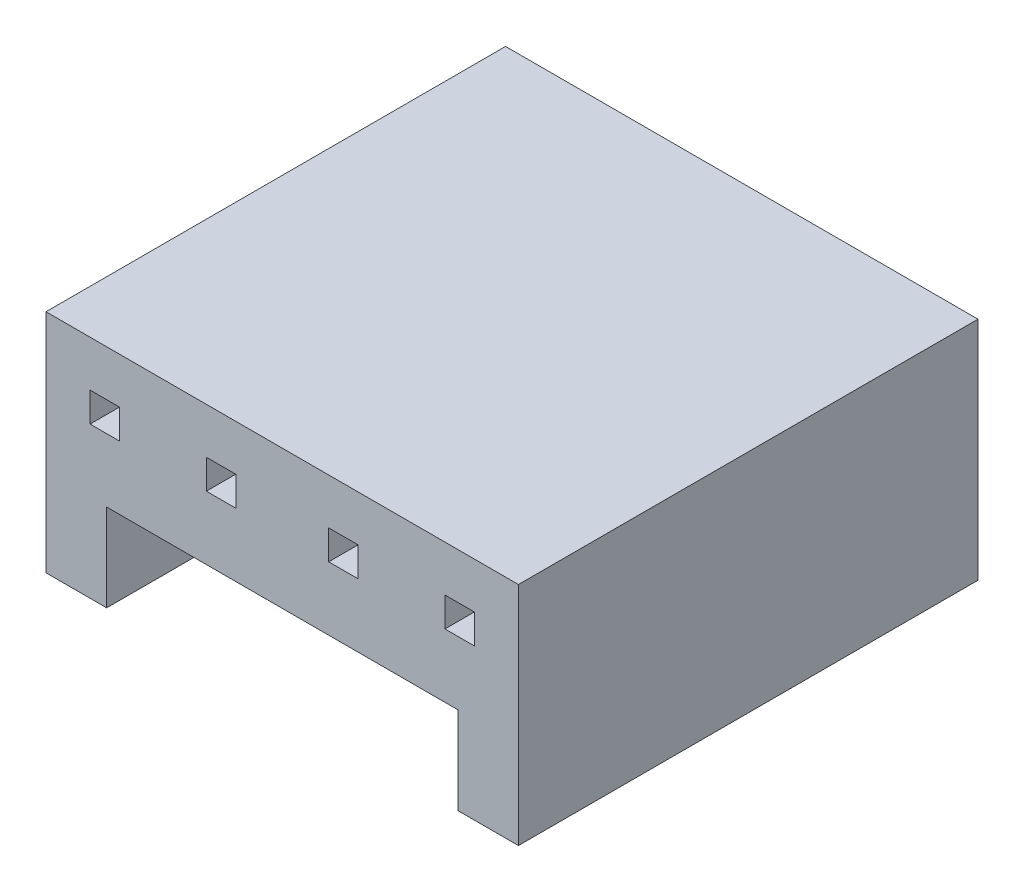
ISO-10303-21;
HEADER;
FILE_DESCRIPTION(('STEP AP214'),'2;1');
FILE_NAME('part.step','',(''),(''),'','','');
FILE_SCHEMA(('AUTOMOTIVE_DESIGN { 1 0 10303 214 1 1 1 1 }'));
ENDSEC;
DATA;
#1=APPLICATION_CONTEXT('core data for automotive mechanical design processes');
#2=APPLICATION_PROTOCOL_DEFINITION('international standard','automotive_design',2000,#1);
#3=PRODUCT_CONTEXT('',#1,'mechanical');
#4=PRODUCT('Part','Part','',(#3));
#5=PRODUCT_RELATED_PRODUCT_CATEGORY('part','',(#4));
#6=PRODUCT_DEFINITION_FORMATION('','',#4);
#7=PRODUCT_DEFINITION_CONTEXT('part definition',#1,'design');
#8=PRODUCT_DEFINITION('design','',#6,#7);
#9=PRODUCT_DEFINITION_SHAPE('','',#8);
#10=(LENGTH_UNIT() NAMED_UNIT(*) SI_UNIT(.MILLI.,.METRE.));
#11=(NAMED_UNIT(*) PLANE_ANGLE_UNIT() SI_UNIT($,.RADIAN.));
#12=(NAMED_UNIT(*) SI_UNIT($,.STERADIAN.) SOLID_ANGLE_UNIT());
#13=UNCERTAINTY_MEASURE_WITH_UNIT(LENGTH_MEASURE(1.E-05),#10,'distance_accuracy_value','');
#14=(GEOMETRIC_REPRESENTATION_CONTEXT(3) GLOBAL_UNCERTAINTY_ASSIGNED_CONTEXT((#13)) GLOBAL_UNIT_ASSIGNED_CONTEXT((#10,
#11,#12)) REPRESENTATION_CONTEXT('',''));
#15=CARTESIAN_POINT('',(0.,0.,0.));
#16=DIRECTION('',(0.,0.,1.));
#17=DIRECTION('',(1.,0.,0.));
#18=AXIS2_PLACEMENT_3D('',#15,#16,#17);
#19=CARTESIAN_POINT('',(0.,0.,-10.));
#20=DIRECTION('',(0.,-1.,0.));
#21=DIRECTION('',(0.,0.,-1.));
#22=AXIS2_PLACEMENT_3D('',#19,#20,#21);
#23=PLANE('',#22);
#24=DIRECTION('',(1.,0.,0.));
#25=VECTOR('',#24,1.);
#26=CARTESIAN_POINT('',(0.,0.,0.));
#27=LINE('',#26,#25);
#28=CARTESIAN_POINT('',(0.,0.,0.));
#29=VERTEX_POINT('',#28);
#30=CARTESIAN_POINT('',(1.32,0.,0.));
#31=VERTEX_POINT('',#30);
#32=EDGE_CURVE('E372',#29,#31,#27,.T.);
#33=ORIENTED_EDGE('',*,*,#32,.F.);
#34=DIRECTION('',(0.,0.,1.));
#35=VECTOR('',#34,1.);
#36=CARTESIAN_POINT('',(0.,0.,-10.));
#37=LINE('',#36,#35);
#38=CARTESIAN_POINT('',(0.,0.,-10.));
#39=VERTEX_POINT('',#38);
#40=EDGE_CURVE('E11',#39,#29,#37,.T.);
#41=ORIENTED_EDGE('',*,*,#40,.F.);
#42=DIRECTION('',(1.,0.,0.));
#43=VECTOR('',#42,1.);
#44=CARTESIAN_POINT('',(0.,0.,-10.));
#45=LINE('',#44,#43);
#46=CARTESIAN_POINT('',(1.32,0.,-10.));
#47=VERTEX_POINT('',#46);
#48=EDGE_CURVE('E382',#39,#47,#45,.T.);
#49=ORIENTED_EDGE('',*,*,#48,.T.);
#50=DIRECTION('',(0.,0.,1.));
#51=VECTOR('',#50,1.);
#52=CARTESIAN_POINT('',(1.32,0.,-10.));
#53=LINE('',#52,#51);
#54=EDGE_CURVE('E42',#47,#31,#53,.T.);
#55=ORIENTED_EDGE('',*,*,#54,.T.);
#56=EDGE_LOOP('',(#33,#41,#49,#55));
#57=FACE_BOUND('',#56,.T.);
#58=ADVANCED_FACE('F39',(#57),#23,.T.);
#59=CARTESIAN_POINT('',(0.,0.,-10.));
#60=DIRECTION('',(-1.,0.,0.));
#61=DIRECTION('',(0.,0.,1.));
#62=AXIS2_PLACEMENT_3D('',#59,#60,#61);
#63=PLANE('',#62);
#64=DIRECTION('',(0.,-1.,0.));
#65=VECTOR('',#64,1.);
#66=CARTESIAN_POINT('',(0.,0.,0.));
#67=LINE('',#66,#65);
#68=CARTESIAN_POINT('',(0.,4.92,0.));
#69=VERTEX_POINT('',#68);
#70=EDGE_CURVE('E387',#69,#29,#67,.T.);
#71=ORIENTED_EDGE('',*,*,#70,.F.);
#72=DIRECTION('',(0.,0.,1.));
#73=VECTOR('',#72,1.);
#74=CARTESIAN_POINT('',(0.,4.92,-10.));
#75=LINE('',#74,#73);
#76=CARTESIAN_POINT('',(0.,4.92,-10.));
#77=VERTEX_POINT('',#76);
#78=EDGE_CURVE('E48',#77,#69,#75,.T.);
#79=ORIENTED_EDGE('',*,*,#78,.F.);
#80=DIRECTION('',(0.,-1.,0.));
#81=VECTOR('',#80,1.);
#82=CARTESIAN_POINT('',(0.,0.,-10.));
#83=LINE('',#82,#81);
#84=EDGE_CURVE('E411',#77,#39,#83,.T.);
#85=ORIENTED_EDGE('',*,*,#84,.T.);
#86=ORIENTED_EDGE('',*,*,#40,.T.);
#87=EDGE_LOOP('',(#71,#79,#85,#86));
#88=FACE_BOUND('',#87,.T.);
#89=ADVANCED_FACE('F474',(#88),#63,.T.);
#90=CARTESIAN_POINT('',(0.,4.92,-10.));
#91=DIRECTION('',(0.,1.,0.));
#92=DIRECTION('',(0.,0.,1.));
#93=AXIS2_PLACEMENT_3D('',#90,#91,#92);
#94=PLANE('',#93);
#95=DIRECTION('',(-1.,0.,0.));
#96=VECTOR('',#95,1.);
#97=CARTESIAN_POINT('',(0.,4.92,0.));
#98=LINE('',#97,#96);
#99=CARTESIAN_POINT('',(10.28,4.92,0.));
#100=VERTEX_POINT('',#99);
#101=EDGE_CURVE('E438',#100,#69,#98,.T.);
#102=ORIENTED_EDGE('',*,*,#101,.F.);
#103=DIRECTION('',(0.,0.,1.));
#104=VECTOR('',#103,1.);
#105=CARTESIAN_POINT('',(10.28,4.92,-10.));
#106=LINE('',#105,#104);
#107=CARTESIAN_POINT('',(10.28,4.92,-10.));
#108=VERTEX_POINT('',#107);
#109=EDGE_CURVE('E447',#108,#100,#106,.T.);
#110=ORIENTED_EDGE('',*,*,#109,.F.);
#111=DIRECTION('',(-1.,0.,0.));
#112=VECTOR('',#111,1.);
#113=CARTESIAN_POINT('',(0.,4.92,-10.));
#114=LINE('',#113,#112);
#115=EDGE_CURVE('E407',#108,#77,#114,.T.);
#116=ORIENTED_EDGE('',*,*,#115,.T.);
#117=ORIENTED_EDGE('',*,*,#78,.T.);
#118=EDGE_LOOP('',(#102,#110,#116,#117));
#119=FACE_BOUND('',#118,.T.);
#120=ADVANCED_FACE('F494',(#119),#94,.T.);
#121=CARTESIAN_POINT('',(10.28,0.,-10.));
#122=DIRECTION('',(1.,0.,0.));
#123=DIRECTION('',(0.,0.,-1.));
#124=AXIS2_PLACEMENT_3D('',#121,#122,#123);
#125=PLANE('',#124);
#126=DIRECTION('',(0.,1.,0.));
#127=VECTOR('',#126,1.);
#128=CARTESIAN_POINT('',(10.28,0.,0.));
#129=LINE('',#128,#127);
#130=CARTESIAN_POINT('',(10.28,0.,0.));
#131=VERTEX_POINT('',#130);
#132=EDGE_CURVE('E434',#131,#100,#129,.T.);
#133=ORIENTED_EDGE('',*,*,#132,.F.);
#134=DIRECTION('',(0.,0.,1.));
#135=VECTOR('',#134,1.);
#136=CARTESIAN_POINT('',(10.28,0.,-10.));
#137=LINE('',#136,#135);
#138=CARTESIAN_POINT('',(10.28,0.,-10.));
#139=VERTEX_POINT('',#138);
#140=EDGE_CURVE('E450',#139,#131,#137,.T.);
#141=ORIENTED_EDGE('',*,*,#140,.F.);
#142=DIRECTION('',(0.,1.,0.));
#143=VECTOR('',#142,1.);
#144=CARTESIAN_POINT('',(10.28,0.,-10.));
#145=LINE('',#144,#143);
#146=EDGE_CURVE('E403',#139,#108,#145,.T.);
#147=ORIENTED_EDGE('',*,*,#146,.T.);
#148=ORIENTED_EDGE('',*,*,#109,.T.);
#149=EDGE_LOOP('',(#133,#141,#147,#148));
#150=FACE_BOUND('',#149,.T.);
#151=ADVANCED_FACE('F492',(#150),#125,.T.);
#152=CARTESIAN_POINT('',(10.28,0.,-10.));
#153=DIRECTION('',(0.,-1.,0.));
#154=DIRECTION('',(0.,0.,-1.));
#155=AXIS2_PLACEMENT_3D('',#152,#153,#154);
#156=PLANE('',#155);
#157=DIRECTION('',(1.,0.,0.));
#158=VECTOR('',#157,1.);
#159=CARTESIAN_POINT('',(10.28,0.,0.));
#160=LINE('',#159,#158);
#161=CARTESIAN_POINT('',(8.96,0.,0.));
#162=VERTEX_POINT('',#161);
#163=EDGE_CURVE('E430',#162,#131,#160,.T.);
#164=ORIENTED_EDGE('',*,*,#163,.F.);
#165=DIRECTION('',(0.,0.,1.));
#166=VECTOR('',#165,1.);
#167=CARTESIAN_POINT('',(8.96,0.,-10.));
#168=LINE('',#167,#166);
#169=CARTESIAN_POINT('',(8.96,0.,-10.));
#170=VERTEX_POINT('',#169);
#171=EDGE_CURVE('E453',#170,#162,#168,.T.);
#172=ORIENTED_EDGE('',*,*,#171,.F.);
#173=DIRECTION('',(1.,0.,0.));
#174=VECTOR('',#173,1.);
#175=CARTESIAN_POINT('',(10.28,0.,-10.));
#176=LINE('',#175,#174);
#177=EDGE_CURVE('E399',#170,#139,#176,.T.);
#178=ORIENTED_EDGE('',*,*,#177,.T.);
#179=ORIENTED_EDGE('',*,*,#140,.T.);
#180=EDGE_LOOP('',(#164,#172,#178,#179));
#181=FACE_BOUND('',#180,.T.);
#182=ADVANCED_FACE('F488',(#181),#156,.T.);
#183=CARTESIAN_POINT('',(8.96,0.,-10.));
#184=DIRECTION('',(-1.,0.,0.));
#185=DIRECTION('',(0.,0.,1.));
#186=AXIS2_PLACEMENT_3D('',#183,#184,#185);
#187=PLANE('',#186);
#188=DIRECTION('',(0.,-1.,0.));
#189=VECTOR('',#188,1.);
#190=CARTESIAN_POINT('',(8.96,0.,0.));
#191=LINE('',#190,#189);
#192=CARTESIAN_POINT('',(8.96,1.9,0.));
#193=VERTEX_POINT('',#192);
#194=EDGE_CURVE('E426',#193,#162,#191,.T.);
#195=ORIENTED_EDGE('',*,*,#194,.F.);
#196=DIRECTION('',(0.,0.,1.));
#197=VECTOR('',#196,1.);
#198=CARTESIAN_POINT('',(8.96,1.9,-10.));
#199=LINE('',#198,#197);
#200=CARTESIAN_POINT('',(8.96,1.9,-10.));
#201=VERTEX_POINT('',#200);
#202=EDGE_CURVE('E456',#201,#193,#199,.T.);
#203=ORIENTED_EDGE('',*,*,#202,.F.);
#204=DIRECTION('',(0.,-1.,0.));
#205=VECTOR('',#204,1.);
#206=CARTESIAN_POINT('',(8.96,0.,-10.));
#207=LINE('',#206,#205);
#208=EDGE_CURVE('E395',#201,#170,#207,.T.);
#209=ORIENTED_EDGE('',*,*,#208,.T.);
#210=ORIENTED_EDGE('',*,*,#171,.T.);
#211=EDGE_LOOP('',(#195,#203,#209,#210));
#212=FACE_BOUND('',#211,.T.);
#213=ADVANCED_FACE('F486',(#212),#187,.T.);
#214=CARTESIAN_POINT('',(1.32,1.9,-10.));
#215=DIRECTION('',(0.,-1.,0.));
#216=DIRECTION('',(1.,0.,0.));
#217=AXIS2_PLACEMENT_3D('',#214,#215,#216);
#218=PLANE('',#217);
#219=DIRECTION('',(1.,0.,0.));
#220=VECTOR('',#219,1.);
#221=CARTESIAN_POINT('',(1.32,1.9,0.));
#222=LINE('',#221,#220);
#223=CARTESIAN_POINT('',(1.32,1.9,0.));
#224=VERTEX_POINT('',#223);
#225=EDGE_CURVE('E422',#224,#193,#222,.T.);
#226=ORIENTED_EDGE('',*,*,#225,.F.);
#227=DIRECTION('',(0.,0.,1.));
#228=VECTOR('',#227,1.);
#229=CARTESIAN_POINT('',(1.32,1.9,-10.));
#230=LINE('',#229,#228);
#231=CARTESIAN_POINT('',(1.32,1.9,-10.));
#232=VERTEX_POINT('',#231);
#233=EDGE_CURVE('E458',#232,#224,#230,.T.);
#234=ORIENTED_EDGE('',*,*,#233,.F.);
#235=DIRECTION('',(1.,0.,0.));
#236=VECTOR('',#235,1.);
#237=CARTESIAN_POINT('',(1.32,1.9,-10.));
#238=LINE('',#237,#236);
#239=EDGE_CURVE('E391',#232,#201,#238,.T.);
#240=ORIENTED_EDGE('',*,*,#239,.T.);
#241=ORIENTED_EDGE('',*,*,#202,.T.);
#242=EDGE_LOOP('',(#226,#234,#240,#241));
#243=FACE_BOUND('',#242,.T.);
#244=ADVANCED_FACE('F482',(#243),#218,.T.);
#245=CARTESIAN_POINT('',(1.32,0.,-10.));
#246=DIRECTION('',(1.,0.,0.));
#247=DIRECTION('',(0.,0.,-1.));
#248=AXIS2_PLACEMENT_3D('',#245,#246,#247);
#249=PLANE('',#248);
#250=DIRECTION('',(0.,1.,0.));
#251=VECTOR('',#250,1.);
#252=CARTESIAN_POINT('',(1.32,0.,0.));
#253=LINE('',#252,#251);
#254=EDGE_CURVE('E418',#31,#224,#253,.T.);
#255=ORIENTED_EDGE('',*,*,#254,.F.);
#256=ORIENTED_EDGE('',*,*,#54,.F.);
#257=DIRECTION('',(0.,1.,0.));
#258=VECTOR('',#257,1.);
#259=CARTESIAN_POINT('',(1.32,0.,-10.));
#260=LINE('',#259,#258);
#261=EDGE_CURVE('E386',#47,#232,#260,.T.);
#262=ORIENTED_EDGE('',*,*,#261,.T.);
#263=ORIENTED_EDGE('',*,*,#233,.T.);
#264=EDGE_LOOP('',(#255,#256,#262,#263));
#265=FACE_BOUND('',#264,.T.);
#266=ADVANCED_FACE('F468',(#265),#249,.T.);
#267=CARTESIAN_POINT('',(0.,0.,-10.));
#268=DIRECTION('',(0.,0.,1.));
#269=DIRECTION('',(1.,0.,0.));
#270=AXIS2_PLACEMENT_3D('',#267,#268,#269);
#271=PLANE('',#270);
#272=DIRECTION('',(0.,1.,0.));
#273=VECTOR('',#272,1.);
#274=CARTESIAN_POINT('',(4.12895977749503,3.28280215856314,-10.));
#275=LINE('',#274,#273);
#276=CARTESIAN_POINT('',(4.12895977749503,3.28280215856314,-10.));
#277=VERTEX_POINT('',#276);
#278=CARTESIAN_POINT('',(4.12895977749503,3.92280215856314,-10.));
#279=VERTEX_POINT('',#278);
#280=EDGE_CURVE('E210',#277,#279,#275,.T.);
#281=ORIENTED_EDGE('',*,*,#280,.T.);
#282=DIRECTION('',(-1.,0.,0.));
#283=VECTOR('',#282,1.);
#284=CARTESIAN_POINT('',(4.12895977749503,3.92280215856314,-10.));
#285=LINE('',#284,#283);
#286=CARTESIAN_POINT('',(3.48895977749503,3.92280215856314,-10.));
#287=VERTEX_POINT('',#286);
#288=EDGE_CURVE('E203',#279,#287,#285,.T.);
#289=ORIENTED_EDGE('',*,*,#288,.T.);
#290=DIRECTION('',(0.,-1.,0.));
#291=VECTOR('',#290,1.);
#292=CARTESIAN_POINT('',(3.48895977749503,3.92280215856314,-10.));
#293=LINE('',#292,#291);
#294=CARTESIAN_POINT('',(3.48895977749503,3.28280215856314,-10.));
#295=VERTEX_POINT('',#294);
#296=EDGE_CURVE('E213',#287,#295,#293,.T.);
#297=ORIENTED_EDGE('',*,*,#296,.T.);
#298=DIRECTION('',(1.,0.,0.));
#299=VECTOR('',#298,1.);
#300=CARTESIAN_POINT('',(3.48895977749503,3.28280215856314,-10.));
#301=LINE('',#300,#299);
#302=EDGE_CURVE('E56',#295,#277,#301,.T.);
#303=ORIENTED_EDGE('',*,*,#302,.T.);
#304=EDGE_LOOP('',(#281,#289,#297,#303));
#305=FACE_BOUND('',#304,.T.);
#306=DIRECTION('',(0.,1.,0.));
#307=VECTOR('',#306,1.);
#308=CARTESIAN_POINT('',(9.32104022250497,3.92280215856314,-10.));
#309=LINE('',#308,#307);
#310=CARTESIAN_POINT('',(9.32104022250497,3.28280215856314,-10.));
#311=VERTEX_POINT('',#310);
#312=CARTESIAN_POINT('',(9.32104022250497,3.92280215856314,-10.));
#313=VERTEX_POINT('',#312);
#314=EDGE_CURVE('E263',#311,#313,#309,.T.);
#315=ORIENTED_EDGE('',*,*,#314,.T.);
#316=DIRECTION('',(-1.,0.,0.));
#317=VECTOR('',#316,1.);
#318=CARTESIAN_POINT('',(9.32104022250497,3.92280215856314,-10.));
#319=LINE('',#318,#317);
#320=CARTESIAN_POINT('',(8.68104022250497,3.92280215856314,-10.));
#321=VERTEX_POINT('',#320);
#322=EDGE_CURVE('E250',#313,#321,#319,.T.);
#323=ORIENTED_EDGE('',*,*,#322,.T.);
#324=DIRECTION('',(0.,-1.,0.));
#325=VECTOR('',#324,1.);
#326=CARTESIAN_POINT('',(8.68104022250497,3.92280215856314,-10.));
#327=LINE('',#326,#325);
#328=CARTESIAN_POINT('',(8.68104022250497,3.28280215856314,-10.));
#329=VERTEX_POINT('',#328);
#330=EDGE_CURVE('E254',#321,#329,#327,.T.);
#331=ORIENTED_EDGE('',*,*,#330,.T.);
#332=DIRECTION('',(1.,0.,0.));
#333=VECTOR('',#332,1.);
#334=CARTESIAN_POINT('',(9.32104022250497,3.28280215856314,-10.));
#335=LINE('',#334,#333);
#336=EDGE_CURVE('E259',#329,#311,#335,.T.);
#337=ORIENTED_EDGE('',*,*,#336,.T.);
#338=EDGE_LOOP('',(#315,#323,#331,#337));
#339=FACE_BOUND('',#338,.T.);
#340=DIRECTION('',(0.,1.,0.));
#341=VECTOR('',#340,1.);
#342=CARTESIAN_POINT('',(1.59895977749503,3.92280215856314,-10.));
#343=LINE('',#342,#341);
#344=CARTESIAN_POINT('',(1.59895977749503,3.28280215856314,-10.));
#345=VERTEX_POINT('',#344);
#346=CARTESIAN_POINT('',(1.59895977749503,3.92280215856314,-10.));
#347=VERTEX_POINT('',#346);
#348=EDGE_CURVE('E307',#345,#347,#343,.T.);
#349=ORIENTED_EDGE('',*,*,#348,.T.);
#350=DIRECTION('',(-1.,0.,0.));
#351=VECTOR('',#350,1.);
#352=CARTESIAN_POINT('',(0.958959777495029,3.92280215856314,-10.));
#353=LINE('',#352,#351);
#354=CARTESIAN_POINT('',(0.958959777495029,3.92280215856314,-10.));
#355=VERTEX_POINT('',#354);
#356=EDGE_CURVE('E294',#347,#355,#353,.T.);
#357=ORIENTED_EDGE('',*,*,#356,.T.);
#358=DIRECTION('',(0.,-1.,0.));
#359=VECTOR('',#358,1.);
#360=CARTESIAN_POINT('',(0.958959777495029,3.92280215856314,-10.));
#361=LINE('',#360,#359);
#362=CARTESIAN_POINT('',(0.958959777495029,3.28280215856314,-10.));
#363=VERTEX_POINT('',#362);
#364=EDGE_CURVE('E298',#355,#363,#361,.T.);
#365=ORIENTED_EDGE('',*,*,#364,.T.);
#366=DIRECTION('',(1.,0.,0.));
#367=VECTOR('',#366,1.);
#368=CARTESIAN_POINT('',(0.958959777495029,3.28280215856314,-10.));
#369=LINE('',#368,#367);
#370=EDGE_CURVE('E303',#363,#345,#369,.T.);
#371=ORIENTED_EDGE('',*,*,#370,.T.);
#372=EDGE_LOOP('',(#349,#357,#365,#371));
#373=FACE_BOUND('',#372,.T.);
#374=DIRECTION('',(-1.,0.,0.));
#375=VECTOR('',#374,1.);
#376=CARTESIAN_POINT('',(6.15104022250497,3.92280215856314,-10.));
#377=LINE('',#376,#375);
#378=CARTESIAN_POINT('',(6.79104022250497,3.92280215856314,-10.));
#379=VERTEX_POINT('',#378);
#380=CARTESIAN_POINT('',(6.15104022250497,3.92280215856314,-10.));
#381=VERTEX_POINT('',#380);
#382=EDGE_CURVE('E351',#379,#381,#377,.T.);
#383=ORIENTED_EDGE('',*,*,#382,.T.);
#384=DIRECTION('',(0.,-1.,0.));
#385=VECTOR('',#384,1.);
#386=CARTESIAN_POINT('',(6.15104022250497,3.28280215856314,-10.));
#387=LINE('',#386,#385);
#388=CARTESIAN_POINT('',(6.15104022250497,3.28280215856314,-10.));
#389=VERTEX_POINT('',#388);
#390=EDGE_CURVE('E338',#381,#389,#387,.T.);
#391=ORIENTED_EDGE('',*,*,#390,.T.);
#392=DIRECTION('',(1.,0.,0.));
#393=VECTOR('',#392,1.);
#394=CARTESIAN_POINT('',(6.79104022250497,3.28280215856314,-10.));
#395=LINE('',#394,#393);
#396=CARTESIAN_POINT('',(6.79104022250497,3.28280215856314,-10.));
#397=VERTEX_POINT('',#396);
#398=EDGE_CURVE('E342',#389,#397,#395,.T.);
#399=ORIENTED_EDGE('',*,*,#398,.T.);
#400=DIRECTION('',(0.,1.,0.));
#401=VECTOR('',#400,1.);
#402=CARTESIAN_POINT('',(6.79104022250497,3.92280215856314,-10.));
#403=LINE('',#402,#401);
#404=EDGE_CURVE('E347',#397,#379,#403,.T.);
#405=ORIENTED_EDGE('',*,*,#404,.T.);
#406=EDGE_LOOP('',(#383,#391,#399,#405));
#407=FACE_BOUND('',#406,.T.);
#408=ORIENTED_EDGE('',*,*,#48,.F.);
#409=ORIENTED_EDGE('',*,*,#84,.F.);
#410=ORIENTED_EDGE('',*,*,#115,.F.);
#411=ORIENTED_EDGE('',*,*,#146,.F.);
#412=ORIENTED_EDGE('',*,*,#177,.F.);
#413=ORIENTED_EDGE('',*,*,#208,.F.);
#414=ORIENTED_EDGE('',*,*,#239,.F.);
#415=ORIENTED_EDGE('',*,*,#261,.F.);
#416=EDGE_LOOP('',(#408,#409,#410,#411,#412,#413,#414,#415));
#417=FACE_BOUND('',#416,.T.);
#418=ADVANCED_FACE('F218',(#305,#339,#373,#407,#417),#271,.F.);
#419=CARTESIAN_POINT('',(0.,0.,0.));
#420=DIRECTION('',(0.,0.,1.));
#421=DIRECTION('',(1.,0.,0.));
#422=AXIS2_PLACEMENT_3D('',#419,#420,#421);
#423=PLANE('',#422);
#424=DIRECTION('',(-1.,0.,0.));
#425=VECTOR('',#424,1.);
#426=CARTESIAN_POINT('',(4.12895977749503,3.92280215856314,0.));
#427=LINE('',#426,#425);
#428=CARTESIAN_POINT('',(4.12895977749503,3.92280215856314,0.));
#429=VERTEX_POINT('',#428);
#430=CARTESIAN_POINT('',(3.48895977749503,3.92280215856314,0.));
#431=VERTEX_POINT('',#430);
#432=EDGE_CURVE('E64',#429,#431,#427,.T.);
#433=ORIENTED_EDGE('',*,*,#432,.F.);
#434=DIRECTION('',(0.,1.,0.));
#435=VECTOR('',#434,1.);
#436=CARTESIAN_POINT('',(4.12895977749503,3.28280215856314,0.));
#437=LINE('',#436,#435);
#438=CARTESIAN_POINT('',(4.12895977749503,3.28280215856314,0.));
#439=VERTEX_POINT('',#438);
#440=EDGE_CURVE('E222',#439,#429,#437,.T.);
#441=ORIENTED_EDGE('',*,*,#440,.F.);
#442=DIRECTION('',(1.,0.,0.));
#443=VECTOR('',#442,1.);
#444=CARTESIAN_POINT('',(3.48895977749503,3.28280215856314,0.));
#445=LINE('',#444,#443);
#446=CARTESIAN_POINT('',(3.48895977749503,3.28280215856314,0.));
#447=VERTEX_POINT('',#446);
#448=EDGE_CURVE('E226',#447,#439,#445,.T.);
#449=ORIENTED_EDGE('',*,*,#448,.F.);
#450=DIRECTION('',(0.,-1.,0.));
#451=VECTOR('',#450,1.);
#452=CARTESIAN_POINT('',(3.48895977749503,3.92280215856314,0.));
#453=LINE('',#452,#451);
#454=EDGE_CURVE('E235',#431,#447,#453,.T.);
#455=ORIENTED_EDGE('',*,*,#454,.F.);
#456=EDGE_LOOP('',(#433,#441,#449,#455));
#457=FACE_BOUND('',#456,.T.);
#458=DIRECTION('',(-1.,0.,0.));
#459=VECTOR('',#458,1.);
#460=CARTESIAN_POINT('',(9.32104022250497,3.92280215856314,0.));
#461=LINE('',#460,#459);
#462=CARTESIAN_POINT('',(9.32104022250497,3.92280215856314,0.));
#463=VERTEX_POINT('',#462);
#464=CARTESIAN_POINT('',(8.68104022250497,3.92280215856314,0.));
#465=VERTEX_POINT('',#464);
#466=EDGE_CURVE('E244',#463,#465,#461,.T.);
#467=ORIENTED_EDGE('',*,*,#466,.F.);
#468=DIRECTION('',(0.,1.,0.));
#469=VECTOR('',#468,1.);
#470=CARTESIAN_POINT('',(9.32104022250497,3.92280215856314,0.));
#471=LINE('',#470,#469);
#472=CARTESIAN_POINT('',(9.32104022250497,3.28280215856314,0.));
#473=VERTEX_POINT('',#472);
#474=EDGE_CURVE('E255',#473,#463,#471,.T.);
#475=ORIENTED_EDGE('',*,*,#474,.F.);
#476=DIRECTION('',(1.,0.,0.));
#477=VECTOR('',#476,1.);
#478=CARTESIAN_POINT('',(9.32104022250497,3.28280215856314,0.));
#479=LINE('',#478,#477);
#480=CARTESIAN_POINT('',(8.68104022250497,3.28280215856314,0.));
#481=VERTEX_POINT('',#480);
#482=EDGE_CURVE('E274',#481,#473,#479,.T.);
#483=ORIENTED_EDGE('',*,*,#482,.F.);
#484=DIRECTION('',(0.,-1.,0.));
#485=VECTOR('',#484,1.);
#486=CARTESIAN_POINT('',(8.68104022250497,3.92280215856314,0.));
#487=LINE('',#486,#485);
#488=EDGE_CURVE('E270',#465,#481,#487,.T.);
#489=ORIENTED_EDGE('',*,*,#488,.F.);
#490=EDGE_LOOP('',(#467,#475,#483,#489));
#491=FACE_BOUND('',#490,.T.);
#492=DIRECTION('',(-1.,0.,0.));
#493=VECTOR('',#492,1.);
#494=CARTESIAN_POINT('',(0.958959777495029,3.92280215856314,0.));
#495=LINE('',#494,#493);
#496=CARTESIAN_POINT('',(1.59895977749503,3.92280215856314,0.));
#497=VERTEX_POINT('',#496);
#498=CARTESIAN_POINT('',(0.958959777495029,3.92280215856314,0.));
#499=VERTEX_POINT('',#498);
#500=EDGE_CURVE('E284',#497,#499,#495,.T.);
#501=ORIENTED_EDGE('',*,*,#500,.F.);
#502=DIRECTION('',(0.,1.,0.));
#503=VECTOR('',#502,1.);
#504=CARTESIAN_POINT('',(1.59895977749503,3.92280215856314,0.));
#505=LINE('',#504,#503);
#506=CARTESIAN_POINT('',(1.59895977749503,3.28280215856314,0.));
#507=VERTEX_POINT('',#506);
#508=EDGE_CURVE('E299',#507,#497,#505,.T.);
#509=ORIENTED_EDGE('',*,*,#508,.F.);
#510=DIRECTION('',(1.,0.,0.));
#511=VECTOR('',#510,1.);
#512=CARTESIAN_POINT('',(0.958959777495029,3.28280215856314,0.));
#513=LINE('',#512,#511);
#514=CARTESIAN_POINT('',(0.958959777495029,3.28280215856314,0.));
#515=VERTEX_POINT('',#514);
#516=EDGE_CURVE('E318',#515,#507,#513,.T.);
#517=ORIENTED_EDGE('',*,*,#516,.F.);
#518=DIRECTION('',(0.,-1.,0.));
#519=VECTOR('',#518,1.);
#520=CARTESIAN_POINT('',(0.958959777495029,3.92280215856314,0.));
#521=LINE('',#520,#519);
#522=EDGE_CURVE('E314',#499,#515,#521,.T.);
#523=ORIENTED_EDGE('',*,*,#522,.F.);
#524=EDGE_LOOP('',(#501,#509,#517,#523));
#525=FACE_BOUND('',#524,.T.);
#526=DIRECTION('',(0.,-1.,0.));
#527=VECTOR('',#526,1.);
#528=CARTESIAN_POINT('',(6.15104022250497,3.28280215856314,0.));
#529=LINE('',#528,#527);
#530=CARTESIAN_POINT('',(6.15104022250497,3.92280215856314,0.));
#531=VERTEX_POINT('',#530);
#532=CARTESIAN_POINT('',(6.15104022250497,3.28280215856314,0.));
#533=VERTEX_POINT('',#532);
#534=EDGE_CURVE('E328',#531,#533,#529,.T.);
#535=ORIENTED_EDGE('',*,*,#534,.F.);
#536=DIRECTION('',(-1.,0.,0.));
#537=VECTOR('',#536,1.);
#538=CARTESIAN_POINT('',(6.15104022250497,3.92280215856314,0.));
#539=LINE('',#538,#537);
#540=CARTESIAN_POINT('',(6.79104022250497,3.92280215856314,0.));
#541=VERTEX_POINT('',#540);
#542=EDGE_CURVE('E343',#541,#531,#539,.T.);
#543=ORIENTED_EDGE('',*,*,#542,.F.);
#544=DIRECTION('',(0.,1.,0.));
#545=VECTOR('',#544,1.);
#546=CARTESIAN_POINT('',(6.79104022250497,3.92280215856314,0.));
#547=LINE('',#546,#545);
#548=CARTESIAN_POINT('',(6.79104022250497,3.28280215856314,0.));
#549=VERTEX_POINT('',#548);
#550=EDGE_CURVE('E362',#549,#541,#547,.T.);
#551=ORIENTED_EDGE('',*,*,#550,.F.);
#552=DIRECTION('',(1.,0.,0.));
#553=VECTOR('',#552,1.);
#554=CARTESIAN_POINT('',(6.79104022250497,3.28280215856314,0.));
#555=LINE('',#554,#553);
#556=EDGE_CURVE('E358',#533,#549,#555,.T.);
#557=ORIENTED_EDGE('',*,*,#556,.F.);
#558=EDGE_LOOP('',(#535,#543,#551,#557));
#559=FACE_BOUND('',#558,.T.);
#560=ORIENTED_EDGE('',*,*,#32,.T.);
#561=ORIENTED_EDGE('',*,*,#254,.T.);
#562=ORIENTED_EDGE('',*,*,#225,.T.);
#563=ORIENTED_EDGE('',*,*,#194,.T.);
#564=ORIENTED_EDGE('',*,*,#163,.T.);
#565=ORIENTED_EDGE('',*,*,#132,.T.);
#566=ORIENTED_EDGE('',*,*,#101,.T.);
#567=ORIENTED_EDGE('',*,*,#70,.T.);
#568=EDGE_LOOP('',(#560,#561,#562,#563,#564,#565,#566,#567));
#569=FACE_BOUND('',#568,.T.);
#570=ADVANCED_FACE('F470',(#457,#491,#525,#559,#569),#423,.T.);
#571=CARTESIAN_POINT('',(6.15104022250497,3.28280215856314,-10.));
#572=DIRECTION('',(-1.,0.,0.));
#573=DIRECTION('',(0.,0.,1.));
#574=AXIS2_PLACEMENT_3D('',#571,#572,#573);
#575=PLANE('',#574);
#576=ORIENTED_EDGE('',*,*,#534,.T.);
#577=DIRECTION('',(0.,0.,1.));
#578=VECTOR('',#577,1.);
#579=CARTESIAN_POINT('',(6.15104022250497,3.28280215856314,-10.));
#580=LINE('',#579,#578);
#581=EDGE_CURVE('E355',#389,#533,#580,.T.);
#582=ORIENTED_EDGE('',*,*,#581,.F.);
#583=ORIENTED_EDGE('',*,*,#390,.F.);
#584=DIRECTION('',(0.,0.,1.));
#585=VECTOR('',#584,1.);
#586=CARTESIAN_POINT('',(6.15104022250497,3.92280215856314,-10.));
#587=LINE('',#586,#585);
#588=EDGE_CURVE('E369',#381,#531,#587,.T.);
#589=ORIENTED_EDGE('',*,*,#588,.T.);
#590=EDGE_LOOP('',(#576,#582,#583,#589));
#591=FACE_BOUND('',#590,.T.);
#592=ADVANCED_FACE('F568',(#591),#575,.F.);
#593=CARTESIAN_POINT('',(6.15104022250497,3.92280215856314,-10.));
#594=DIRECTION('',(0.,1.,0.));
#595=DIRECTION('',(0.,0.,1.));
#596=AXIS2_PLACEMENT_3D('',#593,#594,#595);
#597=PLANE('',#596);
#598=ORIENTED_EDGE('',*,*,#542,.T.);
#599=ORIENTED_EDGE('',*,*,#588,.F.);
#600=ORIENTED_EDGE('',*,*,#382,.F.);
#601=DIRECTION('',(0.,0.,1.));
#602=VECTOR('',#601,1.);
#603=CARTESIAN_POINT('',(6.79104022250497,3.92280215856314,-10.));
#604=LINE('',#603,#602);
#605=EDGE_CURVE('E373',#379,#541,#604,.T.);
#606=ORIENTED_EDGE('',*,*,#605,.T.);
#607=EDGE_LOOP('',(#598,#599,#600,#606));
#608=FACE_BOUND('',#607,.T.);
#609=ADVANCED_FACE('F578',(#608),#597,.F.);
#610=CARTESIAN_POINT('',(6.79104022250497,3.92280215856314,-10.));
#611=DIRECTION('',(1.,0.,0.));
#612=DIRECTION('',(0.,0.,-1.));
#613=AXIS2_PLACEMENT_3D('',#610,#611,#612);
#614=PLANE('',#613);
#615=ORIENTED_EDGE('',*,*,#550,.T.);
#616=ORIENTED_EDGE('',*,*,#605,.F.);
#617=ORIENTED_EDGE('',*,*,#404,.F.);
#618=DIRECTION('',(0.,0.,1.));
#619=VECTOR('',#618,1.);
#620=CARTESIAN_POINT('',(6.79104022250497,3.28280215856314,-10.));
#621=LINE('',#620,#619);
#622=EDGE_CURVE('E376',#397,#549,#621,.T.);
#623=ORIENTED_EDGE('',*,*,#622,.T.);
#624=EDGE_LOOP('',(#615,#616,#617,#623));
#625=FACE_BOUND('',#624,.T.);
#626=ADVANCED_FACE('F588',(#625),#614,.F.);
#627=CARTESIAN_POINT('',(6.79104022250497,3.28280215856314,-10.));
#628=DIRECTION('',(0.,-1.,0.));
#629=DIRECTION('',(0.,0.,-1.));
#630=AXIS2_PLACEMENT_3D('',#627,#628,#629);
#631=PLANE('',#630);
#632=ORIENTED_EDGE('',*,*,#556,.T.);
#633=ORIENTED_EDGE('',*,*,#622,.F.);
#634=ORIENTED_EDGE('',*,*,#398,.F.);
#635=ORIENTED_EDGE('',*,*,#581,.T.);
#636=EDGE_LOOP('',(#632,#633,#634,#635));
#637=FACE_BOUND('',#636,.T.);
#638=ADVANCED_FACE('F598',(#637),#631,.F.);
#639=CARTESIAN_POINT('',(0.958959777495029,3.92280215856314,-10.));
#640=DIRECTION('',(0.,1.,0.));
#641=DIRECTION('',(0.,0.,1.));
#642=AXIS2_PLACEMENT_3D('',#639,#640,#641);
#643=PLANE('',#642);
#644=ORIENTED_EDGE('',*,*,#500,.T.);
#645=DIRECTION('',(0.,0.,1.));
#646=VECTOR('',#645,1.);
#647=CARTESIAN_POINT('',(0.958959777495029,3.92280215856314,-10.));
#648=LINE('',#647,#646);
#649=EDGE_CURVE('E311',#355,#499,#648,.T.);
#650=ORIENTED_EDGE('',*,*,#649,.F.);
#651=ORIENTED_EDGE('',*,*,#356,.F.);
#652=DIRECTION('',(0.,0.,1.));
#653=VECTOR('',#652,1.);
#654=CARTESIAN_POINT('',(1.59895977749503,3.92280215856314,-10.));
#655=LINE('',#654,#653);
#656=EDGE_CURVE('E325',#347,#497,#655,.T.);
#657=ORIENTED_EDGE('',*,*,#656,.T.);
#658=EDGE_LOOP('',(#644,#650,#651,#657));
#659=FACE_BOUND('',#658,.T.);
#660=ADVANCED_FACE('F608',(#659),#643,.F.);
#661=CARTESIAN_POINT('',(1.59895977749503,3.92280215856314,-10.));
#662=DIRECTION('',(1.,0.,0.));
#663=DIRECTION('',(0.,0.,-1.));
#664=AXIS2_PLACEMENT_3D('',#661,#662,#663);
#665=PLANE('',#664);
#666=ORIENTED_EDGE('',*,*,#508,.T.);
#667=ORIENTED_EDGE('',*,*,#656,.F.);
#668=ORIENTED_EDGE('',*,*,#348,.F.);
#669=DIRECTION('',(0.,0.,1.));
#670=VECTOR('',#669,1.);
#671=CARTESIAN_POINT('',(1.59895977749503,3.28280215856314,-10.));
#672=LINE('',#671,#670);
#673=EDGE_CURVE('E329',#345,#507,#672,.T.);
#674=ORIENTED_EDGE('',*,*,#673,.T.);
#675=EDGE_LOOP('',(#666,#667,#668,#674));
#676=FACE_BOUND('',#675,.T.);
#677=ADVANCED_FACE('F618',(#676),#665,.F.);
#678=CARTESIAN_POINT('',(0.958959777495029,3.28280215856314,-10.));
#679=DIRECTION('',(0.,-1.,0.));
#680=DIRECTION('',(0.,0.,-1.));
#681=AXIS2_PLACEMENT_3D('',#678,#679,#680);
#682=PLANE('',#681);
#683=ORIENTED_EDGE('',*,*,#516,.T.);
#684=ORIENTED_EDGE('',*,*,#673,.F.);
#685=ORIENTED_EDGE('',*,*,#370,.F.);
#686=DIRECTION('',(0.,0.,1.));
#687=VECTOR('',#686,1.);
#688=CARTESIAN_POINT('',(0.958959777495029,3.28280215856314,-10.));
#689=LINE('',#688,#687);
#690=EDGE_CURVE('E332',#363,#515,#689,.T.);
#691=ORIENTED_EDGE('',*,*,#690,.T.);
#692=EDGE_LOOP('',(#683,#684,#685,#691));
#693=FACE_BOUND('',#692,.T.);
#694=ADVANCED_FACE('F628',(#693),#682,.F.);
#695=CARTESIAN_POINT('',(0.958959777495029,3.92280215856314,-10.));
#696=DIRECTION('',(-1.,0.,0.));
#697=DIRECTION('',(0.,0.,1.));
#698=AXIS2_PLACEMENT_3D('',#695,#696,#697);
#699=PLANE('',#698);
#700=ORIENTED_EDGE('',*,*,#522,.T.);
#701=ORIENTED_EDGE('',*,*,#690,.F.);
#702=ORIENTED_EDGE('',*,*,#364,.F.);
#703=ORIENTED_EDGE('',*,*,#649,.T.);
#704=EDGE_LOOP('',(#700,#701,#702,#703));
#705=FACE_BOUND('',#704,.T.);
#706=ADVANCED_FACE('F638',(#705),#699,.F.);
#707=CARTESIAN_POINT('',(9.32104022250497,3.92280215856314,-10.));
#708=DIRECTION('',(0.,1.,0.));
#709=DIRECTION('',(0.,0.,1.));
#710=AXIS2_PLACEMENT_3D('',#707,#708,#709);
#711=PLANE('',#710);
#712=ORIENTED_EDGE('',*,*,#466,.T.);
#713=DIRECTION('',(0.,0.,1.));
#714=VECTOR('',#713,1.);
#715=CARTESIAN_POINT('',(8.68104022250497,3.92280215856314,-10.));
#716=LINE('',#715,#714);
#717=EDGE_CURVE('E267',#321,#465,#716,.T.);
#718=ORIENTED_EDGE('',*,*,#717,.F.);
#719=ORIENTED_EDGE('',*,*,#322,.F.);
#720=DIRECTION('',(0.,0.,1.));
#721=VECTOR('',#720,1.);
#722=CARTESIAN_POINT('',(9.32104022250497,3.92280215856314,-10.));
#723=LINE('',#722,#721);
#724=EDGE_CURVE('E281',#313,#463,#723,.T.);
#725=ORIENTED_EDGE('',*,*,#724,.T.);
#726=EDGE_LOOP('',(#712,#718,#719,#725));
#727=FACE_BOUND('',#726,.T.);
#728=ADVANCED_FACE('F648',(#727),#711,.F.);
#729=CARTESIAN_POINT('',(9.32104022250497,3.92280215856314,-10.));
#730=DIRECTION('',(1.,0.,0.));
#731=DIRECTION('',(0.,0.,-1.));
#732=AXIS2_PLACEMENT_3D('',#729,#730,#731);
#733=PLANE('',#732);
#734=ORIENTED_EDGE('',*,*,#474,.T.);
#735=ORIENTED_EDGE('',*,*,#724,.F.);
#736=ORIENTED_EDGE('',*,*,#314,.F.);
#737=DIRECTION('',(0.,0.,1.));
#738=VECTOR('',#737,1.);
#739=CARTESIAN_POINT('',(9.32104022250497,3.28280215856314,-10.));
#740=LINE('',#739,#738);
#741=EDGE_CURVE('E285',#311,#473,#740,.T.);
#742=ORIENTED_EDGE('',*,*,#741,.T.);
#743=EDGE_LOOP('',(#734,#735,#736,#742));
#744=FACE_BOUND('',#743,.T.);
#745=ADVANCED_FACE('F658',(#744),#733,.F.);
#746=CARTESIAN_POINT('',(9.32104022250497,3.28280215856314,-10.));
#747=DIRECTION('',(0.,-1.,0.));
#748=DIRECTION('',(0.,0.,-1.));
#749=AXIS2_PLACEMENT_3D('',#746,#747,#748);
#750=PLANE('',#749);
#751=ORIENTED_EDGE('',*,*,#482,.T.);
#752=ORIENTED_EDGE('',*,*,#741,.F.);
#753=ORIENTED_EDGE('',*,*,#336,.F.);
#754=DIRECTION('',(0.,0.,1.));
#755=VECTOR('',#754,1.);
#756=CARTESIAN_POINT('',(8.68104022250497,3.28280215856314,-10.));
#757=LINE('',#756,#755);
#758=EDGE_CURVE('E288',#329,#481,#757,.T.);
#759=ORIENTED_EDGE('',*,*,#758,.T.);
#760=EDGE_LOOP('',(#751,#752,#753,#759));
#761=FACE_BOUND('',#760,.T.);
#762=ADVANCED_FACE('F668',(#761),#750,.F.);
#763=CARTESIAN_POINT('',(8.68104022250497,3.92280215856314,-10.));
#764=DIRECTION('',(-1.,0.,0.));
#765=DIRECTION('',(0.,0.,1.));
#766=AXIS2_PLACEMENT_3D('',#763,#764,#765);
#767=PLANE('',#766);
#768=ORIENTED_EDGE('',*,*,#488,.T.);
#769=ORIENTED_EDGE('',*,*,#758,.F.);
#770=ORIENTED_EDGE('',*,*,#330,.F.);
#771=ORIENTED_EDGE('',*,*,#717,.T.);
#772=EDGE_LOOP('',(#768,#769,#770,#771));
#773=FACE_BOUND('',#772,.T.);
#774=ADVANCED_FACE('F678',(#773),#767,.F.);
#775=CARTESIAN_POINT('',(4.12895977749503,3.92280215856314,-10.));
#776=DIRECTION('',(0.,1.,0.));
#777=DIRECTION('',(0.,0.,1.));
#778=AXIS2_PLACEMENT_3D('',#775,#776,#777);
#779=PLANE('',#778);
#780=ORIENTED_EDGE('',*,*,#432,.T.);
#781=DIRECTION('',(0.,0.,1.));
#782=VECTOR('',#781,1.);
#783=CARTESIAN_POINT('',(3.48895977749503,3.92280215856314,-10.));
#784=LINE('',#783,#782);
#785=EDGE_CURVE('E199',#287,#431,#784,.T.);
#786=ORIENTED_EDGE('',*,*,#785,.F.);
#787=ORIENTED_EDGE('',*,*,#288,.F.);
#788=DIRECTION('',(0.,0.,1.));
#789=VECTOR('',#788,1.);
#790=CARTESIAN_POINT('',(4.12895977749503,3.92280215856314,-10.));
#791=LINE('',#790,#789);
#792=EDGE_CURVE('E241',#279,#429,#791,.T.);
#793=ORIENTED_EDGE('',*,*,#792,.T.);
#794=EDGE_LOOP('',(#780,#786,#787,#793));
#795=FACE_BOUND('',#794,.T.);
#796=ADVANCED_FACE('F201',(#795),#779,.F.);
#797=CARTESIAN_POINT('',(4.12895977749503,3.28280215856314,-10.));
#798=DIRECTION('',(1.,0.,0.));
#799=DIRECTION('',(0.,0.,-1.));
#800=AXIS2_PLACEMENT_3D('',#797,#798,#799);
#801=PLANE('',#800);
#802=ORIENTED_EDGE('',*,*,#440,.T.);
#803=ORIENTED_EDGE('',*,*,#792,.F.);
#804=ORIENTED_EDGE('',*,*,#280,.F.);
#805=DIRECTION('',(0.,0.,1.));
#806=VECTOR('',#805,1.);
#807=CARTESIAN_POINT('',(4.12895977749503,3.28280215856314,-10.));
#808=LINE('',#807,#806);
#809=EDGE_CURVE('E245',#277,#439,#808,.T.);
#810=ORIENTED_EDGE('',*,*,#809,.T.);
#811=EDGE_LOOP('',(#802,#803,#804,#810));
#812=FACE_BOUND('',#811,.T.);
#813=ADVANCED_FACE('F697',(#812),#801,.F.);
#814=CARTESIAN_POINT('',(3.48895977749503,3.28280215856314,-10.));
#815=DIRECTION('',(0.,-1.,0.));
#816=DIRECTION('',(0.,0.,-1.));
#817=AXIS2_PLACEMENT_3D('',#814,#815,#816);
#818=PLANE('',#817);
#819=ORIENTED_EDGE('',*,*,#448,.T.);
#820=ORIENTED_EDGE('',*,*,#809,.F.);
#821=ORIENTED_EDGE('',*,*,#302,.F.);
#822=DIRECTION('',(0.,0.,1.));
#823=VECTOR('',#822,1.);
#824=CARTESIAN_POINT('',(3.48895977749503,3.28280215856314,-10.));
#825=LINE('',#824,#823);
#826=EDGE_CURVE('E209',#295,#447,#825,.T.);
#827=ORIENTED_EDGE('',*,*,#826,.T.);
#828=EDGE_LOOP('',(#819,#820,#821,#827));
#829=FACE_BOUND('',#828,.T.);
#830=ADVANCED_FACE('F706',(#829),#818,.F.);
#831=CARTESIAN_POINT('',(3.48895977749503,3.92280215856314,-10.));
#832=DIRECTION('',(-1.,0.,0.));
#833=DIRECTION('',(0.,0.,1.));
#834=AXIS2_PLACEMENT_3D('',#831,#832,#833);
#835=PLANE('',#834);
#836=ORIENTED_EDGE('',*,*,#454,.T.);
#837=ORIENTED_EDGE('',*,*,#826,.F.);
#838=ORIENTED_EDGE('',*,*,#296,.F.);
#839=ORIENTED_EDGE('',*,*,#785,.T.);
#840=EDGE_LOOP('',(#836,#837,#838,#839));
#841=FACE_BOUND('',#840,.T.);
#842=ADVANCED_FACE('F214',(#841),#835,.F.);
#843=CLOSED_SHELL('',(#58,#89,#120,#151,#182,#213,#244,#266,#418,#570,#592,#609,#626,#638,#660,
#677,#694,#706,#728,#745,#762,#774,#796,#813,#830,#842));
#844=MANIFOLD_SOLID_BREP('B2',#843);
#845=ADVANCED_BREP_SHAPE_REPRESENTATION('',(#18,#844),#14);
#846=SHAPE_DEFINITION_REPRESENTATION(#9,#845);
ENDSEC;
END-ISO-10303-21;
